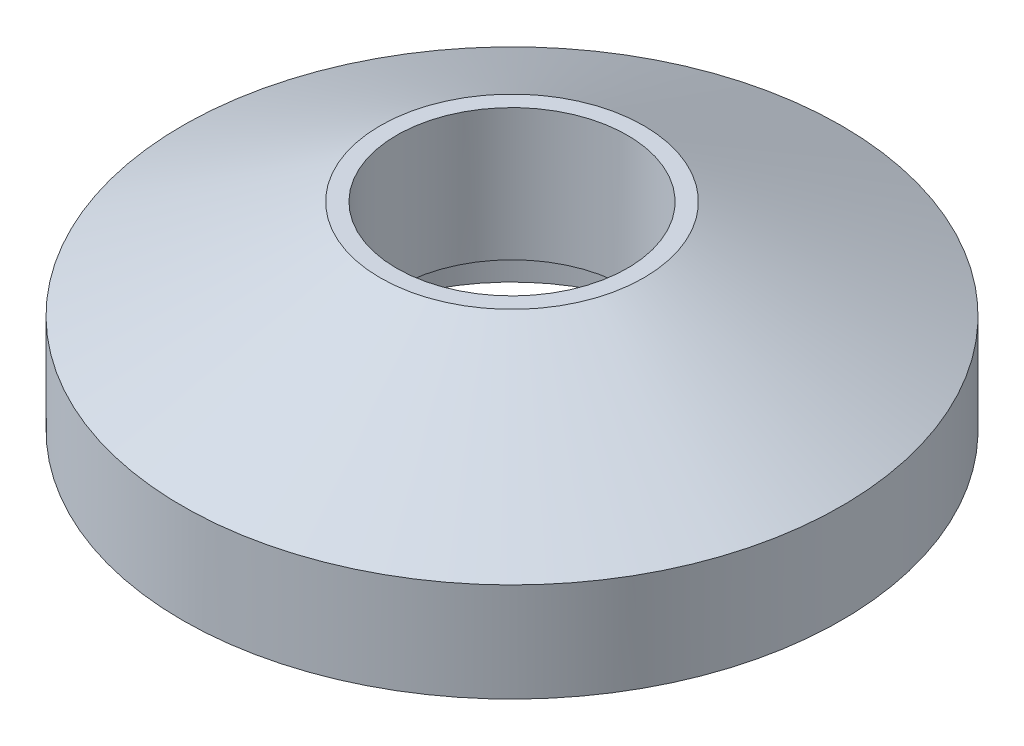
ISO-10303-21;
HEADER;
FILE_DESCRIPTION(('STEP AP214'),'2;1');
FILE_NAME('part.step','',(''),(''),'','','');
FILE_SCHEMA(('AUTOMOTIVE_DESIGN { 1 0 10303 214 1 1 1 1 }'));
ENDSEC;
DATA;
#1=APPLICATION_CONTEXT('core data for automotive mechanical design processes');
#2=APPLICATION_PROTOCOL_DEFINITION('international standard','automotive_design',2000,#1);
#3=PRODUCT_CONTEXT('',#1,'mechanical');
#4=PRODUCT('Part','Part','',(#3));
#5=PRODUCT_RELATED_PRODUCT_CATEGORY('part','',(#4));
#6=PRODUCT_DEFINITION_FORMATION('','',#4);
#7=PRODUCT_DEFINITION_CONTEXT('part definition',#1,'design');
#8=PRODUCT_DEFINITION('design','',#6,#7);
#9=PRODUCT_DEFINITION_SHAPE('','',#8);
#10=(LENGTH_UNIT() NAMED_UNIT(*) SI_UNIT(.MILLI.,.METRE.));
#11=(NAMED_UNIT(*) PLANE_ANGLE_UNIT() SI_UNIT($,.RADIAN.));
#12=(NAMED_UNIT(*) SI_UNIT($,.STERADIAN.) SOLID_ANGLE_UNIT());
#13=UNCERTAINTY_MEASURE_WITH_UNIT(LENGTH_MEASURE(1.E-05),#10,'distance_accuracy_value','');
#14=(GEOMETRIC_REPRESENTATION_CONTEXT(3) GLOBAL_UNCERTAINTY_ASSIGNED_CONTEXT((#13)) GLOBAL_UNIT_ASSIGNED_CONTEXT((#10,
#11,#12)) REPRESENTATION_CONTEXT('',''));
#15=CARTESIAN_POINT('',(0.,0.,0.));
#16=DIRECTION('',(0.,0.,1.));
#17=DIRECTION('',(1.,0.,0.));
#18=AXIS2_PLACEMENT_3D('',#15,#16,#17);
#19=CARTESIAN_POINT('',(0.,0.,0.));
#20=DIRECTION('',(0.,1.,0.));
#21=DIRECTION('',(0.,0.,1.));
#22=AXIS2_PLACEMENT_3D('',#19,#20,#21);
#23=CYLINDRICAL_SURFACE('',#22,17.5);
#24=CARTESIAN_POINT('',(0.,30.,0.));
#25=DIRECTION('',(0.,1.,0.));
#26=DIRECTION('',(0.,0.,1.));
#27=AXIS2_PLACEMENT_3D('',#24,#25,#26);
#28=CIRCLE('',#27,17.5);
#29=CARTESIAN_POINT('',(0.,30.,17.5));
#30=VERTEX_POINT('',#29);
#31=EDGE_CURVE('E59',#30,#30,#28,.T.);
#32=ORIENTED_EDGE('',*,*,#31,.T.);
#33=EDGE_LOOP('',(#32));
#34=FACE_BOUND('',#33,.T.);
#35=CARTESIAN_POINT('',(0.,10.,0.));
#36=DIRECTION('',(0.,-1.,0.));
#37=DIRECTION('',(0.,0.,-1.));
#38=AXIS2_PLACEMENT_3D('',#35,#36,#37);
#39=CIRCLE('',#38,17.5);
#40=CARTESIAN_POINT('',(0.,10.,-17.5));
#41=VERTEX_POINT('',#40);
#42=EDGE_CURVE('E42',#41,#41,#39,.F.);
#43=ORIENTED_EDGE('',*,*,#42,.F.);
#44=EDGE_LOOP('',(#43));
#45=FACE_BOUND('',#44,.T.);
#46=ADVANCED_FACE('F38',(#34,#45),#23,.F.);
#47=CARTESIAN_POINT('',(0.,15.,0.));
#48=DIRECTION('',(0.,-1.,0.));
#49=DIRECTION('',(0.,0.,-1.));
#50=AXIS2_PLACEMENT_3D('',#47,#48,#49);
#51=CYLINDRICAL_SURFACE('',#50,50.);
#52=CARTESIAN_POINT('',(0.,15.,0.));
#53=DIRECTION('',(0.,-1.,0.));
#54=DIRECTION('',(0.,0.,-1.));
#55=AXIS2_PLACEMENT_3D('',#52,#53,#54);
#56=CIRCLE('',#55,50.);
#57=CARTESIAN_POINT('',(0.,15.,-50.));
#58=VERTEX_POINT('',#57);
#59=EDGE_CURVE('E11',#58,#58,#56,.F.);
#60=ORIENTED_EDGE('',*,*,#59,.F.);
#61=EDGE_LOOP('',(#60));
#62=FACE_BOUND('',#61,.T.);
#63=CARTESIAN_POINT('',(0.,0.,0.));
#64=DIRECTION('',(0.,1.,0.));
#65=DIRECTION('',(0.,0.,1.));
#66=AXIS2_PLACEMENT_3D('',#63,#64,#65);
#67=CIRCLE('',#66,50.);
#68=CARTESIAN_POINT('',(0.,0.,50.));
#69=VERTEX_POINT('',#68);
#70=EDGE_CURVE('E46',#69,#69,#67,.T.);
#71=ORIENTED_EDGE('',*,*,#70,.T.);
#72=EDGE_LOOP('',(#71));
#73=FACE_BOUND('',#72,.T.);
#74=ADVANCED_FACE('F40',(#62,#73),#51,.T.);
#75=CARTESIAN_POINT('',(0.,0.,0.));
#76=DIRECTION('',(0.,1.,0.));
#77=DIRECTION('',(0.,0.,1.));
#78=AXIS2_PLACEMENT_3D('',#75,#76,#77);
#79=PLANE('',#78);
#80=CARTESIAN_POINT('',(0.,0.,0.));
#81=DIRECTION('',(0.,-1.,0.));
#82=DIRECTION('',(0.,0.,-1.));
#83=AXIS2_PLACEMENT_3D('',#80,#81,#82);
#84=CIRCLE('',#83,27.5);
#85=CARTESIAN_POINT('',(0.,0.,-27.5));
#86=VERTEX_POINT('',#85);
#87=EDGE_CURVE('E95',#86,#86,#84,.T.);
#88=ORIENTED_EDGE('',*,*,#87,.F.);
#89=EDGE_LOOP('',(#88));
#90=FACE_BOUND('',#89,.T.);
#91=ORIENTED_EDGE('',*,*,#70,.F.);
#92=EDGE_LOOP('',(#91));
#93=FACE_BOUND('',#92,.T.);
#94=ADVANCED_FACE('F76',(#90,#93),#79,.F.);
#95=CARTESIAN_POINT('',(0.,30.,0.));
#96=DIRECTION('',(0.,1.,0.));
#97=DIRECTION('',(0.,0.,1.));
#98=AXIS2_PLACEMENT_3D('',#95,#96,#97);
#99=PLANE('',#98);
#100=ORIENTED_EDGE('',*,*,#31,.F.);
#101=EDGE_LOOP('',(#100));
#102=FACE_BOUND('',#101,.T.);
#103=CARTESIAN_POINT('',(0.,30.,0.));
#104=DIRECTION('',(0.,1.,0.));
#105=DIRECTION('',(0.,0.,1.));
#106=AXIS2_PLACEMENT_3D('',#103,#104,#105);
#107=CIRCLE('',#106,20.);
#108=CARTESIAN_POINT('',(0.,30.,20.));
#109=VERTEX_POINT('',#108);
#110=EDGE_CURVE('E51',#109,#109,#107,.T.);
#111=ORIENTED_EDGE('',*,*,#110,.T.);
#112=EDGE_LOOP('',(#111));
#113=FACE_BOUND('',#112,.T.);
#114=ADVANCED_FACE('F65',(#102,#113),#99,.T.);
#115=CARTESIAN_POINT('',(0.,30.,0.));
#116=DIRECTION('',(0.,-1.,0.));
#117=DIRECTION('',(0.,0.,-1.));
#118=AXIS2_PLACEMENT_3D('',#115,#116,#117);
#119=CONICAL_SURFACE('',#118,20.,1.10714871779409);
#120=ORIENTED_EDGE('',*,*,#110,.F.);
#121=EDGE_LOOP('',(#120));
#122=FACE_BOUND('',#121,.T.);
#123=ORIENTED_EDGE('',*,*,#59,.T.);
#124=EDGE_LOOP('',(#123));
#125=FACE_BOUND('',#124,.T.);
#126=ADVANCED_FACE('F75',(#122,#125),#119,.T.);
#127=CARTESIAN_POINT('',(0.,10.,0.));
#128=DIRECTION('',(0.,-1.,0.));
#129=DIRECTION('',(0.,0.,-1.));
#130=AXIS2_PLACEMENT_3D('',#127,#128,#129);
#131=PLANE('',#130);
#132=CARTESIAN_POINT('',(0.,10.,0.));
#133=DIRECTION('',(0.,-1.,0.));
#134=DIRECTION('',(0.,0.,-1.));
#135=AXIS2_PLACEMENT_3D('',#132,#133,#134);
#136=CIRCLE('',#135,27.5);
#137=CARTESIAN_POINT('',(0.,10.,-27.5));
#138=VERTEX_POINT('',#137);
#139=EDGE_CURVE('E98',#138,#138,#136,.T.);
#140=ORIENTED_EDGE('',*,*,#139,.T.);
#141=EDGE_LOOP('',(#140));
#142=FACE_BOUND('',#141,.T.);
#143=ORIENTED_EDGE('',*,*,#42,.T.);
#144=EDGE_LOOP('',(#143));
#145=FACE_BOUND('',#144,.T.);
#146=ADVANCED_FACE('F81',(#142,#145),#131,.T.);
#147=CARTESIAN_POINT('',(0.,10.,0.));
#148=DIRECTION('',(0.,-1.,0.));
#149=DIRECTION('',(0.,0.,-1.));
#150=AXIS2_PLACEMENT_3D('',#147,#148,#149);
#151=CYLINDRICAL_SURFACE('',#150,27.5);
#152=ORIENTED_EDGE('',*,*,#139,.F.);
#153=EDGE_LOOP('',(#152));
#154=FACE_BOUND('',#153,.T.);
#155=ORIENTED_EDGE('',*,*,#87,.T.);
#156=EDGE_LOOP('',(#155));
#157=FACE_BOUND('',#156,.T.);
#158=ADVANCED_FACE('F125',(#154,#157),#151,.F.);
#159=CLOSED_SHELL('',(#46,#74,#94,#114,#126,#146,#158));
#160=MANIFOLD_SOLID_BREP('B2',#159);
#161=ADVANCED_BREP_SHAPE_REPRESENTATION('',(#18,#160),#14);
#162=SHAPE_DEFINITION_REPRESENTATION(#9,#161);
ENDSEC;
END-ISO-10303-21;
